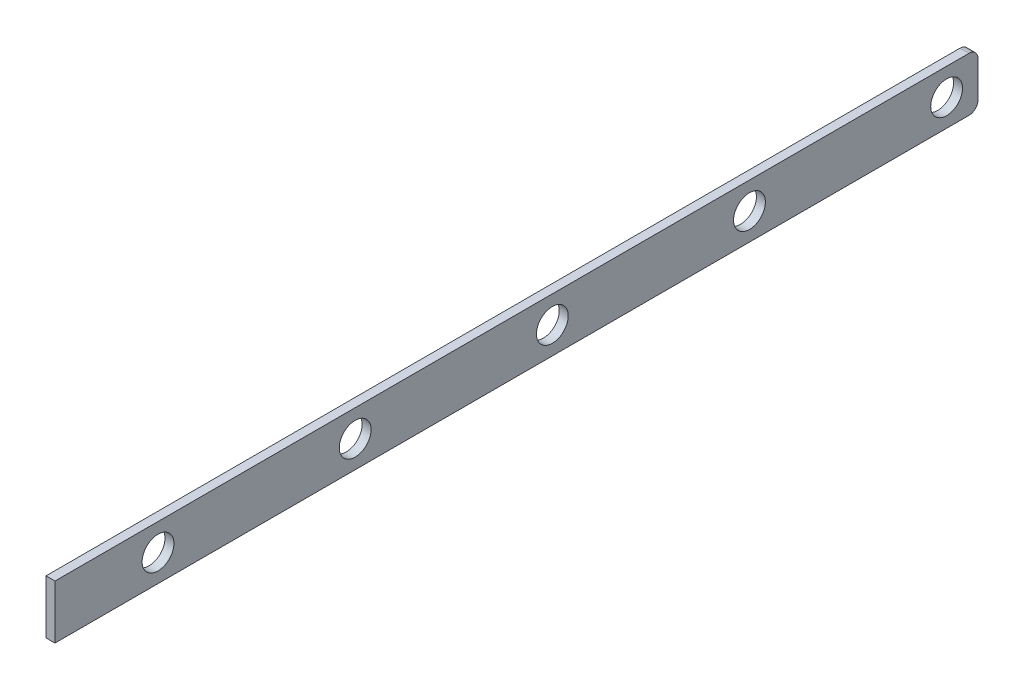
ISO-10303-21;
HEADER;
FILE_DESCRIPTION(('STEP AP214'),'2;1');
FILE_NAME('part.step','',(''),(''),'','','');
FILE_SCHEMA(('AUTOMOTIVE_DESIGN { 1 0 10303 214 1 1 1 1 }'));
ENDSEC;
DATA;
#1=APPLICATION_CONTEXT('core data for automotive mechanical design processes');
#2=APPLICATION_PROTOCOL_DEFINITION('international standard','automotive_design',2000,#1);
#3=PRODUCT_CONTEXT('',#1,'mechanical');
#4=PRODUCT('Part','Part','',(#3));
#5=PRODUCT_RELATED_PRODUCT_CATEGORY('part','',(#4));
#6=PRODUCT_DEFINITION_FORMATION('','',#4);
#7=PRODUCT_DEFINITION_CONTEXT('part definition',#1,'design');
#8=PRODUCT_DEFINITION('design','',#6,#7);
#9=PRODUCT_DEFINITION_SHAPE('','',#8);
#10=(LENGTH_UNIT() NAMED_UNIT(*) SI_UNIT(.MILLI.,.METRE.));
#11=(NAMED_UNIT(*) PLANE_ANGLE_UNIT() SI_UNIT($,.RADIAN.));
#12=(NAMED_UNIT(*) SI_UNIT($,.STERADIAN.) SOLID_ANGLE_UNIT());
#13=UNCERTAINTY_MEASURE_WITH_UNIT(LENGTH_MEASURE(1.E-05),#10,'distance_accuracy_value','');
#14=(GEOMETRIC_REPRESENTATION_CONTEXT(3) GLOBAL_UNCERTAINTY_ASSIGNED_CONTEXT((#13)) GLOBAL_UNIT_ASSIGNED_CONTEXT((#10,
#11,#12)) REPRESENTATION_CONTEXT('',''));
#15=CARTESIAN_POINT('',(0.,0.,0.));
#16=DIRECTION('',(0.,0.,1.));
#17=DIRECTION('',(1.,0.,0.));
#18=AXIS2_PLACEMENT_3D('',#15,#16,#17);
#19=CARTESIAN_POINT('',(-610.,-60.0000000000018,-445.));
#20=DIRECTION('',(0.,0.999999999999999,0.));
#21=DIRECTION('',(0.,0.,0.999999999999999));
#22=AXIS2_PLACEMENT_3D('',#19,#20,#21);
#23=PLANE('',#22);
#24=DIRECTION('',(-1.,0.,0.));
#25=VECTOR('',#24,1.);
#26=CARTESIAN_POINT('',(-610.,-60.0000000000017,445.));
#27=LINE('',#26,#25);
#28=CARTESIAN_POINT('',(-600.,-60.0000000000011,445.));
#29=VERTEX_POINT('',#28);
#30=CARTESIAN_POINT('',(-610.,-60.0000000000017,445.));
#31=VERTEX_POINT('',#30);
#32=EDGE_CURVE('E170',#29,#31,#27,.T.);
#33=ORIENTED_EDGE('',*,*,#32,.T.);
#34=DIRECTION('',(0.,0.,0.999999999999999));
#35=VECTOR('',#34,1.);
#36=CARTESIAN_POINT('',(-610.,-60.0000000000018,-445.));
#37=LINE('',#36,#35);
#38=CARTESIAN_POINT('',(-610.,-60.0000000000017,-575.));
#39=VERTEX_POINT('',#38);
#40=EDGE_CURVE('E11',#39,#31,#37,.T.);
#41=ORIENTED_EDGE('',*,*,#40,.F.);
#42=DIRECTION('',(-1.,0.,0.));
#43=VECTOR('',#42,1.);
#44=CARTESIAN_POINT('',(-600.,-60.0000000000011,-575.));
#45=LINE('',#44,#43);
#46=CARTESIAN_POINT('',(-600.,-60.0000000000011,-575.));
#47=VERTEX_POINT('',#46);
#48=EDGE_CURVE('E142',#47,#39,#45,.T.);
#49=ORIENTED_EDGE('',*,*,#48,.F.);
#50=DIRECTION('',(0.,0.,0.999999999999999));
#51=VECTOR('',#50,1.);
#52=CARTESIAN_POINT('',(-600.,-60.0000000000011,-445.));
#53=LINE('',#52,#51);
#54=EDGE_CURVE('E101',#47,#29,#53,.T.);
#55=ORIENTED_EDGE('',*,*,#54,.T.);
#56=EDGE_LOOP('',(#33,#41,#49,#55));
#57=FACE_BOUND('',#56,.T.);
#58=ADVANCED_FACE('F40',(#57),#23,.F.);
#59=CARTESIAN_POINT('',(-610.,-60.0000000000018,-445.));
#60=DIRECTION('',(1.,0.,0.));
#61=DIRECTION('',(0.,0.,-0.999999999999999));
#62=AXIS2_PLACEMENT_3D('',#59,#60,#61);
#63=PLANE('',#62);
#64=CARTESIAN_POINT('',(-610.000000000001,-30.0000000000147,330.));
#65=DIRECTION('',(-1.,0.,0.));
#66=DIRECTION('',(0.,0.,1.));
#67=AXIS2_PLACEMENT_3D('',#64,#65,#66);
#68=CIRCLE('',#67,17.75);
#69=CARTESIAN_POINT('',(-610.000000000001,-30.0000000000147,347.75));
#70=VERTEX_POINT('',#69);
#71=EDGE_CURVE('E146',#70,#70,#68,.T.);
#72=ORIENTED_EDGE('',*,*,#71,.F.);
#73=EDGE_LOOP('',(#72));
#74=FACE_BOUND('',#73,.T.);
#75=CARTESIAN_POINT('',(-610.,-30.0000000000147,110.));
#76=DIRECTION('',(-1.,0.,0.));
#77=DIRECTION('',(0.,0.,1.));
#78=AXIS2_PLACEMENT_3D('',#75,#76,#77);
#79=CIRCLE('',#78,17.75);
#80=CARTESIAN_POINT('',(-610.,-30.0000000000147,127.75));
#81=VERTEX_POINT('',#80);
#82=EDGE_CURVE('E155',#81,#81,#79,.T.);
#83=ORIENTED_EDGE('',*,*,#82,.F.);
#84=EDGE_LOOP('',(#83));
#85=FACE_BOUND('',#84,.T.);
#86=CARTESIAN_POINT('',(-610.000000000001,-30.0000000000148,-110.));
#87=DIRECTION('',(-1.,0.,0.));
#88=DIRECTION('',(0.,0.,1.));
#89=AXIS2_PLACEMENT_3D('',#86,#87,#88);
#90=CIRCLE('',#89,17.75);
#91=CARTESIAN_POINT('',(-610.000000000001,-30.0000000000148,-92.2500000000001));
#92=VERTEX_POINT('',#91);
#93=EDGE_CURVE('E160',#92,#92,#90,.T.);
#94=ORIENTED_EDGE('',*,*,#93,.F.);
#95=EDGE_LOOP('',(#94));
#96=FACE_BOUND('',#95,.T.);
#97=CARTESIAN_POINT('',(-610.,-30.0000000000153,-330.));
#98=DIRECTION('',(-1.,0.,0.));
#99=DIRECTION('',(0.,0.,1.));
#100=AXIS2_PLACEMENT_3D('',#97,#98,#99);
#101=CIRCLE('',#100,17.75);
#102=CARTESIAN_POINT('',(-610.,-30.0000000000153,-312.25));
#103=VERTEX_POINT('',#102);
#104=EDGE_CURVE('E165',#103,#103,#101,.T.);
#105=ORIENTED_EDGE('',*,*,#104,.F.);
#106=EDGE_LOOP('',(#105));
#107=FACE_BOUND('',#106,.T.);
#108=DIRECTION('',(0.,0.999999999999999,0.));
#109=VECTOR('',#108,1.);
#110=CARTESIAN_POINT('',(-610.,-60.0000000000017,445.));
#111=LINE('',#110,#109);
#112=CARTESIAN_POINT('',(-610.,-1.33226762955019E-12,445.));
#113=VERTEX_POINT('',#112);
#114=EDGE_CURVE('E174',#31,#113,#111,.T.);
#115=ORIENTED_EDGE('',*,*,#114,.T.);
#116=DIRECTION('',(0.,0.,0.999999999999999));
#117=VECTOR('',#116,1.);
#118=CARTESIAN_POINT('',(-610.,-6.66133814775094E-13,-445.));
#119=LINE('',#118,#117);
#120=CARTESIAN_POINT('',(-610.,-6.66133814775094E-13,-575.));
#121=VERTEX_POINT('',#120);
#122=EDGE_CURVE('E49',#121,#113,#119,.T.);
#123=ORIENTED_EDGE('',*,*,#122,.F.);
#124=CARTESIAN_POINT('',(-609.999999999999,-10.0000000000007,-575.));
#125=DIRECTION('',(-1.,0.,0.));
#126=DIRECTION('',(0.,0.,0.999999999999999));
#127=AXIS2_PLACEMENT_3D('',#124,#125,#126);
#128=CIRCLE('',#127,10.0000000000001);
#129=CARTESIAN_POINT('',(-610.,-10.0000000000002,-585.));
#130=VERTEX_POINT('',#129);
#131=EDGE_CURVE('E108',#121,#130,#128,.T.);
#132=ORIENTED_EDGE('',*,*,#131,.T.);
#133=DIRECTION('',(0.,-1.,0.));
#134=VECTOR('',#133,1.);
#135=CARTESIAN_POINT('',(-610.,-10.0000000000002,-585.));
#136=LINE('',#135,#134);
#137=CARTESIAN_POINT('',(-610.,-50.0000000000018,-585.));
#138=VERTEX_POINT('',#137);
#139=EDGE_CURVE('E127',#130,#138,#136,.T.);
#140=ORIENTED_EDGE('',*,*,#139,.T.);
#141=CARTESIAN_POINT('',(-610.,-50.000000000001,-575.));
#142=DIRECTION('',(-1.,0.,0.));
#143=DIRECTION('',(0.,0.,0.999999999999999));
#144=AXIS2_PLACEMENT_3D('',#141,#142,#143);
#145=CIRCLE('',#144,9.99999999999993);
#146=EDGE_CURVE('E120',#138,#39,#145,.T.);
#147=ORIENTED_EDGE('',*,*,#146,.T.);
#148=ORIENTED_EDGE('',*,*,#40,.T.);
#149=EDGE_LOOP('',(#115,#123,#132,#140,#147,#148));
#150=FACE_BOUND('',#149,.T.);
#151=CARTESIAN_POINT('',(-610.,-30.0000000000006,-550.000000000001));
#152=DIRECTION('',(-1.,0.,0.));
#153=DIRECTION('',(0.,0.,0.999999999999999));
#154=AXIS2_PLACEMENT_3D('',#151,#152,#153);
#155=CIRCLE('',#154,17.7500000000003);
#156=CARTESIAN_POINT('',(-610.,-30.0000000000006,-532.25));
#157=VERTEX_POINT('',#156);
#158=EDGE_CURVE('E130',#157,#157,#155,.T.);
#159=ORIENTED_EDGE('',*,*,#158,.F.);
#160=EDGE_LOOP('',(#159));
#161=FACE_BOUND('',#160,.T.);
#162=ADVANCED_FACE('F215',(#74,#85,#96,#107,#150,#161),#63,.F.);
#163=CARTESIAN_POINT('',(-600.,0.,-445.));
#164=DIRECTION('',(0.,-0.999999999999999,0.));
#165=DIRECTION('',(0.,0.,-0.999999999999999));
#166=AXIS2_PLACEMENT_3D('',#163,#164,#165);
#167=PLANE('',#166);
#168=DIRECTION('',(1.,0.,0.));
#169=VECTOR('',#168,1.);
#170=CARTESIAN_POINT('',(-600.,-6.66133814775094E-13,445.));
#171=LINE('',#170,#169);
#172=CARTESIAN_POINT('',(-600.,-6.66133814775094E-13,445.));
#173=VERTEX_POINT('',#172);
#174=EDGE_CURVE('E65',#113,#173,#171,.T.);
#175=ORIENTED_EDGE('',*,*,#174,.T.);
#176=DIRECTION('',(0.,0.,0.999999999999999));
#177=VECTOR('',#176,1.);
#178=CARTESIAN_POINT('',(-600.,0.,-445.));
#179=LINE('',#178,#177);
#180=CARTESIAN_POINT('',(-600.,0.,-575.));
#181=VERTEX_POINT('',#180);
#182=EDGE_CURVE('E94',#181,#173,#179,.T.);
#183=ORIENTED_EDGE('',*,*,#182,.F.);
#184=DIRECTION('',(-1.,0.,0.));
#185=VECTOR('',#184,1.);
#186=CARTESIAN_POINT('',(-600.,0.,-575.));
#187=LINE('',#186,#185);
#188=EDGE_CURVE('E97',#181,#121,#187,.T.);
#189=ORIENTED_EDGE('',*,*,#188,.T.);
#190=ORIENTED_EDGE('',*,*,#122,.T.);
#191=EDGE_LOOP('',(#175,#183,#189,#190));
#192=FACE_BOUND('',#191,.T.);
#193=ADVANCED_FACE('F96',(#192),#167,.F.);
#194=CARTESIAN_POINT('',(-600.,-60.0000000000011,-445.));
#195=DIRECTION('',(-1.,0.,0.));
#196=DIRECTION('',(0.,0.,0.999999999999999));
#197=AXIS2_PLACEMENT_3D('',#194,#195,#196);
#198=PLANE('',#197);
#199=CARTESIAN_POINT('',(-600.,-30.0000000000142,330.000000000001));
#200=DIRECTION('',(-1.,0.,0.));
#201=DIRECTION('',(0.,0.,0.999999999999999));
#202=AXIS2_PLACEMENT_3D('',#199,#200,#201);
#203=CIRCLE('',#202,17.75);
#204=CARTESIAN_POINT('',(-600.,-30.0000000000142,347.750000000001));
#205=VERTEX_POINT('',#204);
#206=EDGE_CURVE('E43',#205,#205,#203,.T.);
#207=ORIENTED_EDGE('',*,*,#206,.T.);
#208=EDGE_LOOP('',(#207));
#209=FACE_BOUND('',#208,.T.);
#210=CARTESIAN_POINT('',(-600.,-30.000000000014,110.));
#211=DIRECTION('',(-1.,0.,0.));
#212=DIRECTION('',(0.,0.,0.999999999999999));
#213=AXIS2_PLACEMENT_3D('',#210,#211,#212);
#214=CIRCLE('',#213,17.75);
#215=CARTESIAN_POINT('',(-600.,-30.000000000014,127.75));
#216=VERTEX_POINT('',#215);
#217=EDGE_CURVE('E159',#216,#216,#214,.T.);
#218=ORIENTED_EDGE('',*,*,#217,.T.);
#219=EDGE_LOOP('',(#218));
#220=FACE_BOUND('',#219,.T.);
#221=CARTESIAN_POINT('',(-600.000000000001,-30.0000000000141,-110.));
#222=DIRECTION('',(-1.,0.,0.));
#223=DIRECTION('',(0.,0.,0.999999999999999));
#224=AXIS2_PLACEMENT_3D('',#221,#222,#223);
#225=CIRCLE('',#224,17.75);
#226=CARTESIAN_POINT('',(-600.000000000001,-30.0000000000141,-92.25));
#227=VERTEX_POINT('',#226);
#228=EDGE_CURVE('E164',#227,#227,#225,.T.);
#229=ORIENTED_EDGE('',*,*,#228,.T.);
#230=EDGE_LOOP('',(#229));
#231=FACE_BOUND('',#230,.T.);
#232=CARTESIAN_POINT('',(-600.,-30.0000000000147,-330.));
#233=DIRECTION('',(-1.,0.,0.));
#234=DIRECTION('',(0.,0.,0.999999999999999));
#235=AXIS2_PLACEMENT_3D('',#232,#233,#234);
#236=CIRCLE('',#235,17.75);
#237=CARTESIAN_POINT('',(-600.,-30.0000000000147,-312.25));
#238=VERTEX_POINT('',#237);
#239=EDGE_CURVE('E169',#238,#238,#236,.T.);
#240=ORIENTED_EDGE('',*,*,#239,.T.);
#241=EDGE_LOOP('',(#240));
#242=FACE_BOUND('',#241,.T.);
#243=DIRECTION('',(0.,-0.999999999999999,0.));
#244=VECTOR('',#243,1.);
#245=CARTESIAN_POINT('',(-600.,-60.0000000000011,445.));
#246=LINE('',#245,#244);
#247=EDGE_CURVE('E57',#173,#29,#246,.T.);
#248=ORIENTED_EDGE('',*,*,#247,.T.);
#249=ORIENTED_EDGE('',*,*,#54,.F.);
#250=CARTESIAN_POINT('',(-600.,-50.0000000000005,-575.));
#251=DIRECTION('',(-1.,0.,0.));
#252=DIRECTION('',(0.,0.,0.999999999999999));
#253=AXIS2_PLACEMENT_3D('',#250,#251,#252);
#254=CIRCLE('',#253,9.99999999999993);
#255=CARTESIAN_POINT('',(-600.,-50.0000000000017,-585.));
#256=VERTEX_POINT('',#255);
#257=EDGE_CURVE('E111',#256,#47,#254,.T.);
#258=ORIENTED_EDGE('',*,*,#257,.F.);
#259=DIRECTION('',(0.,-1.,0.));
#260=VECTOR('',#259,1.);
#261=CARTESIAN_POINT('',(-600.,-9.9999999999999,-585.));
#262=LINE('',#261,#260);
#263=CARTESIAN_POINT('',(-600.,-9.9999999999999,-585.));
#264=VERTEX_POINT('',#263);
#265=EDGE_CURVE('E118',#264,#256,#262,.T.);
#266=ORIENTED_EDGE('',*,*,#265,.F.);
#267=CARTESIAN_POINT('',(-599.999999999999,-9.9999999999999,-575.));
#268=DIRECTION('',(-1.,0.,0.));
#269=DIRECTION('',(0.,0.,0.999999999999999));
#270=AXIS2_PLACEMENT_3D('',#267,#268,#269);
#271=CIRCLE('',#270,10.0000000000001);
#272=EDGE_CURVE('E106',#181,#264,#271,.T.);
#273=ORIENTED_EDGE('',*,*,#272,.F.);
#274=ORIENTED_EDGE('',*,*,#182,.T.);
#275=EDGE_LOOP('',(#248,#249,#258,#266,#273,#274));
#276=FACE_BOUND('',#275,.T.);
#277=CARTESIAN_POINT('',(-600.,-29.9999999999998,-550.000000000001));
#278=DIRECTION('',(-1.,0.,0.));
#279=DIRECTION('',(0.,0.,0.999999999999999));
#280=AXIS2_PLACEMENT_3D('',#277,#278,#279);
#281=CIRCLE('',#280,17.7500000000003);
#282=CARTESIAN_POINT('',(-600.,-29.9999999999998,-532.25));
#283=VERTEX_POINT('',#282);
#284=EDGE_CURVE('E138',#283,#283,#281,.T.);
#285=ORIENTED_EDGE('',*,*,#284,.T.);
#286=EDGE_LOOP('',(#285));
#287=FACE_BOUND('',#286,.T.);
#288=ADVANCED_FACE('F114',(#209,#220,#231,#242,#276,#287),#198,.F.);
#289=CARTESIAN_POINT('',(-5.00000000000006,-30.0000000000006,445.));
#290=DIRECTION('',(0.,0.,0.999999999999999));
#291=DIRECTION('',(1.,0.,0.));
#292=AXIS2_PLACEMENT_3D('',#289,#290,#291);
#293=PLANE('',#292);
#294=ORIENTED_EDGE('',*,*,#32,.F.);
#295=ORIENTED_EDGE('',*,*,#247,.F.);
#296=ORIENTED_EDGE('',*,*,#174,.F.);
#297=ORIENTED_EDGE('',*,*,#114,.F.);
#298=EDGE_LOOP('',(#294,#295,#296,#297));
#299=FACE_BOUND('',#298,.T.);
#300=ADVANCED_FACE('F224',(#299),#293,.T.);
#301=CARTESIAN_POINT('',(610.,-30.0000000000146,-330.000000000001));
#302=DIRECTION('',(-1.,0.,0.));
#303=DIRECTION('',(0.,0.,1.));
#304=AXIS2_PLACEMENT_3D('',#301,#302,#303);
#305=CYLINDRICAL_SURFACE('',#304,17.75);
#306=ORIENTED_EDGE('',*,*,#104,.T.);
#307=EDGE_LOOP('',(#306));
#308=FACE_BOUND('',#307,.T.);
#309=ORIENTED_EDGE('',*,*,#239,.F.);
#310=EDGE_LOOP('',(#309));
#311=FACE_BOUND('',#310,.T.);
#312=ADVANCED_FACE('F211',(#308,#311),#305,.F.);
#313=CARTESIAN_POINT('',(610.,-30.0000000000146,-110.000000000001));
#314=DIRECTION('',(-1.,0.,0.));
#315=DIRECTION('',(0.,0.,1.));
#316=AXIS2_PLACEMENT_3D('',#313,#314,#315);
#317=CYLINDRICAL_SURFACE('',#316,17.75);
#318=ORIENTED_EDGE('',*,*,#93,.T.);
#319=EDGE_LOOP('',(#318));
#320=FACE_BOUND('',#319,.T.);
#321=ORIENTED_EDGE('',*,*,#228,.F.);
#322=EDGE_LOOP('',(#321));
#323=FACE_BOUND('',#322,.T.);
#324=ADVANCED_FACE('F201',(#320,#323),#317,.F.);
#325=CARTESIAN_POINT('',(610.000000000001,-30.0000000000147,109.999999999999));
#326=DIRECTION('',(-1.,0.,0.));
#327=DIRECTION('',(0.,0.,1.));
#328=AXIS2_PLACEMENT_3D('',#325,#326,#327);
#329=CYLINDRICAL_SURFACE('',#328,17.75);
#330=ORIENTED_EDGE('',*,*,#82,.T.);
#331=EDGE_LOOP('',(#330));
#332=FACE_BOUND('',#331,.T.);
#333=ORIENTED_EDGE('',*,*,#217,.F.);
#334=EDGE_LOOP('',(#333));
#335=FACE_BOUND('',#334,.T.);
#336=ADVANCED_FACE('F198',(#332,#335),#329,.F.);
#337=CARTESIAN_POINT('',(610.,-30.000000000014,330.));
#338=DIRECTION('',(-1.,0.,0.));
#339=DIRECTION('',(0.,0.,1.));
#340=AXIS2_PLACEMENT_3D('',#337,#338,#339);
#341=CYLINDRICAL_SURFACE('',#340,17.75);
#342=ORIENTED_EDGE('',*,*,#71,.T.);
#343=EDGE_LOOP('',(#342));
#344=FACE_BOUND('',#343,.T.);
#345=ORIENTED_EDGE('',*,*,#206,.F.);
#346=EDGE_LOOP('',(#345));
#347=FACE_BOUND('',#346,.T.);
#348=ADVANCED_FACE('F200',(#344,#347),#341,.F.);
#349=CARTESIAN_POINT('',(-600.,-50.0000000000005,-575.));
#350=DIRECTION('',(-1.,0.,0.));
#351=DIRECTION('',(0.,0.,0.999999999999999));
#352=AXIS2_PLACEMENT_3D('',#349,#350,#351);
#353=CYLINDRICAL_SURFACE('',#352,9.99999999999993);
#354=ORIENTED_EDGE('',*,*,#146,.F.);
#355=DIRECTION('',(-1.,0.,0.));
#356=VECTOR('',#355,1.);
#357=CARTESIAN_POINT('',(-600.,-50.0000000000017,-585.));
#358=LINE('',#357,#356);
#359=EDGE_CURVE('E147',#256,#138,#358,.T.);
#360=ORIENTED_EDGE('',*,*,#359,.F.);
#361=ORIENTED_EDGE('',*,*,#257,.T.);
#362=ORIENTED_EDGE('',*,*,#48,.T.);
#363=EDGE_LOOP('',(#354,#360,#361,#362));
#364=FACE_BOUND('',#363,.T.);
#365=ADVANCED_FACE('F208',(#364),#353,.T.);
#366=CARTESIAN_POINT('',(-600.,-9.9999999999999,-585.));
#367=DIRECTION('',(0.,0.,-1.));
#368=DIRECTION('',(0.,1.,0.));
#369=AXIS2_PLACEMENT_3D('',#366,#367,#368);
#370=PLANE('',#369);
#371=ORIENTED_EDGE('',*,*,#139,.F.);
#372=DIRECTION('',(-1.,0.,0.));
#373=VECTOR('',#372,1.);
#374=CARTESIAN_POINT('',(-600.,-9.9999999999999,-585.));
#375=LINE('',#374,#373);
#376=EDGE_CURVE('E110',#264,#130,#375,.T.);
#377=ORIENTED_EDGE('',*,*,#376,.F.);
#378=ORIENTED_EDGE('',*,*,#265,.T.);
#379=ORIENTED_EDGE('',*,*,#359,.T.);
#380=EDGE_LOOP('',(#371,#377,#378,#379));
#381=FACE_BOUND('',#380,.T.);
#382=ADVANCED_FACE('F231',(#381),#370,.T.);
#383=CARTESIAN_POINT('',(-599.999999999999,-9.9999999999999,-575.));
#384=DIRECTION('',(-1.,0.,0.));
#385=DIRECTION('',(0.,0.,0.999999999999999));
#386=AXIS2_PLACEMENT_3D('',#383,#384,#385);
#387=CYLINDRICAL_SURFACE('',#386,10.0000000000001);
#388=ORIENTED_EDGE('',*,*,#131,.F.);
#389=ORIENTED_EDGE('',*,*,#188,.F.);
#390=ORIENTED_EDGE('',*,*,#272,.T.);
#391=ORIENTED_EDGE('',*,*,#376,.T.);
#392=EDGE_LOOP('',(#388,#389,#390,#391));
#393=FACE_BOUND('',#392,.T.);
#394=ADVANCED_FACE('F105',(#393),#387,.T.);
#395=CARTESIAN_POINT('',(-600.,-29.9999999999998,-550.000000000001));
#396=DIRECTION('',(-1.,0.,0.));
#397=DIRECTION('',(0.,0.,0.999999999999999));
#398=AXIS2_PLACEMENT_3D('',#395,#396,#397);
#399=CYLINDRICAL_SURFACE('',#398,17.7500000000003);
#400=ORIENTED_EDGE('',*,*,#284,.F.);
#401=EDGE_LOOP('',(#400));
#402=FACE_BOUND('',#401,.T.);
#403=ORIENTED_EDGE('',*,*,#158,.T.);
#404=EDGE_LOOP('',(#403));
#405=FACE_BOUND('',#404,.T.);
#406=ADVANCED_FACE('F238',(#402,#405),#399,.F.);
#407=CLOSED_SHELL('',(#58,#162,#193,#288,#300,#312,#324,#336,#348,#365,#382,#394,#406));
#408=MANIFOLD_SOLID_BREP('B2',#407);
#409=ADVANCED_BREP_SHAPE_REPRESENTATION('',(#18,#408),#14);
#410=SHAPE_DEFINITION_REPRESENTATION(#9,#409);
ENDSEC;
END-ISO-10303-21;
